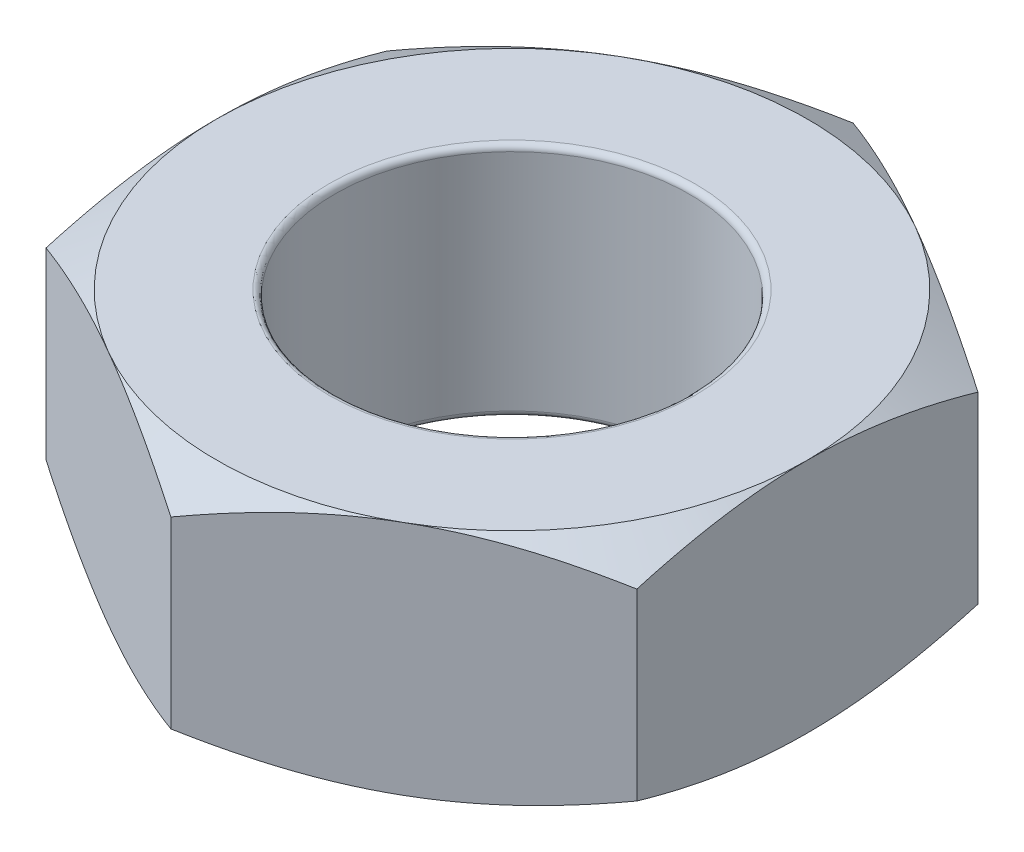
ISO-10303-21;
HEADER;
FILE_DESCRIPTION(('STEP AP214'),'2;1');
FILE_NAME('part.step','',(''),(''),'','','');
FILE_SCHEMA(('AUTOMOTIVE_DESIGN { 1 0 10303 214 1 1 1 1 }'));
ENDSEC;
DATA;
#1=APPLICATION_CONTEXT('core data for automotive mechanical design processes');
#2=APPLICATION_PROTOCOL_DEFINITION('international standard','automotive_design',2000,#1);
#3=PRODUCT_CONTEXT('',#1,'mechanical');
#4=PRODUCT('Part','Part','',(#3));
#5=PRODUCT_RELATED_PRODUCT_CATEGORY('part','',(#4));
#6=PRODUCT_DEFINITION_FORMATION('','',#4);
#7=PRODUCT_DEFINITION_CONTEXT('part definition',#1,'design');
#8=PRODUCT_DEFINITION('design','',#6,#7);
#9=PRODUCT_DEFINITION_SHAPE('','',#8);
#10=(LENGTH_UNIT() NAMED_UNIT(*) SI_UNIT(.MILLI.,.METRE.));
#11=(NAMED_UNIT(*) PLANE_ANGLE_UNIT() SI_UNIT($,.RADIAN.));
#12=(NAMED_UNIT(*) SI_UNIT($,.STERADIAN.) SOLID_ANGLE_UNIT());
#13=UNCERTAINTY_MEASURE_WITH_UNIT(LENGTH_MEASURE(1.E-05),#10,'distance_accuracy_value','');
#14=(GEOMETRIC_REPRESENTATION_CONTEXT(3) GLOBAL_UNCERTAINTY_ASSIGNED_CONTEXT((#13)) GLOBAL_UNIT_ASSIGNED_CONTEXT((#10,
#11,#12)) REPRESENTATION_CONTEXT('',''));
#15=CARTESIAN_POINT('',(0.,0.,0.));
#16=DIRECTION('',(0.,0.,1.));
#17=DIRECTION('',(1.,0.,0.));
#18=AXIS2_PLACEMENT_3D('',#15,#16,#17);
#19=CARTESIAN_POINT('',(0.,2.,2.88675134594813));
#20=DIRECTION('',(-0.5,0.,-0.866025403784439));
#21=DIRECTION('',(-0.866025403784439,0.,0.5));
#22=AXIS2_PLACEMENT_3D('',#19,#20,#21);
#23=PLANE('',#22);
#24=CARTESIAN_POINT('',(2.5002,0.223357664359108,1.44326020292023));
#25=CARTESIAN_POINT('',(2.39033676526513,0.186721620107626,1.50668977106845));
#26=CARTESIAN_POINT('',(2.27952520010347,0.153402218965056,1.57066685804385));
#27=CARTESIAN_POINT('',(2.05598316653395,0.0952422855578578,1.69972891130041));
#28=CARTESIAN_POINT('',(1.94324872547161,0.0704223291477384,1.7648161711947));
#29=CARTESIAN_POINT('',(1.71917700612473,0.0317856514410522,1.8941840386774));
#30=CARTESIAN_POINT('',(1.60787420823262,0.0177117961856392,1.95844473900197));
#31=CARTESIAN_POINT('',(1.38474477253167,0.00090915235275052,2.08726857876805));
#32=CARTESIAN_POINT('',(1.27291894598577,-0.00183354879637316,2.15183124982667));
#33=CARTESIAN_POINT('',(1.06395802444848,0.00386576000805371,2.27247489412634));
#34=CARTESIAN_POINT('',(0.966791682442268,0.0109083943818619,2.32857390783979));
#35=CARTESIAN_POINT('',(0.773092050288997,0.0332314191249426,2.44040644260542));
#36=CARTESIAN_POINT('',(0.676559430340267,0.0485194384402671,2.4961395767184));
#37=CARTESIAN_POINT('',(0.482460278259523,0.0867390938444202,2.60820277442169));
#38=CARTESIAN_POINT('',(0.384918318217858,0.109832776125517,2.66451865130903));
#39=CARTESIAN_POINT('',(0.191289391923914,0.162246656577913,2.77631036402774));
#40=CARTESIAN_POINT('',(0.0951999441138228,0.191554535624548,2.83178763258718));
#41=CARTESIAN_POINT('',(-0.00020000000000132,0.223357664359108,2.88686681600197));
#42=B_SPLINE_CURVE_WITH_KNOTS('',3,(#24,#25,#26,#27,#28,#29,#30,#31,#32,#33,#34,#35,#36,#37,#38,
#39,#40,#41),.UNSPECIFIED.,.F.,.F.,(4,2,2,2,2,2,2,2,4),(0.,0.396285827362227,0.793524330152051,
1.18093086852114,1.56786160134475,1.90479741793733,2.24204551660463,2.58677531536756,
2.93082800105256),.UNSPECIFIED.);
#43=CARTESIAN_POINT('',(2.5,0.223290993692602,1.44337567297407));
#44=VERTEX_POINT('',#43);
#45=CARTESIAN_POINT('',(1.25,0.,2.1650635094611));
#46=VERTEX_POINT('',#45);
#47=EDGE_CURVE('E128',#44,#46,#42,.T.);
#48=ORIENTED_EDGE('',*,*,#47,.F.);
#49=DIRECTION('',(0.,-1.,0.));
#50=VECTOR('',#49,1.);
#51=CARTESIAN_POINT('',(2.5,2.,1.44337567297407));
#52=LINE('',#51,#50);
#53=CARTESIAN_POINT('',(2.5,1.7767090063074,1.44337567297407));
#54=VERTEX_POINT('',#53);
#55=EDGE_CURVE('E234',#54,#44,#52,.T.);
#56=ORIENTED_EDGE('',*,*,#55,.F.);
#57=CARTESIAN_POINT('',(-0.000200000000001105,1.77664233564089,2.88686681600197));
#58=CARTESIAN_POINT('',(0.10966323473487,1.81327837989237,2.82343724785375));
#59=CARTESIAN_POINT('',(0.220474799896525,1.84659778103494,2.75946016087834));
#60=CARTESIAN_POINT('',(0.444016833466049,1.90475771444214,2.63039810762178));
#61=CARTESIAN_POINT('',(0.556751274528387,1.92957767085226,2.5653108477275));
#62=CARTESIAN_POINT('',(0.780822993875268,1.96821434855895,2.43594298024479));
#63=CARTESIAN_POINT('',(0.892125791767376,1.98228820381436,2.37168227992023));
#64=CARTESIAN_POINT('',(1.11525522746833,1.99909084764725,2.24285844015415));
#65=CARTESIAN_POINT('',(1.22708105401423,2.00183354879637,2.17829576909553));
#66=CARTESIAN_POINT('',(1.43604197555152,1.99613423999195,2.05765212479586));
#67=CARTESIAN_POINT('',(1.53320831755773,1.98909160561814,2.0015531110824));
#68=CARTESIAN_POINT('',(1.726907949711,1.96676858087506,1.88972057631678));
#69=CARTESIAN_POINT('',(1.82344056965973,1.95148056155973,1.8339874422038));
#70=CARTESIAN_POINT('',(2.01753972174048,1.91326090615558,1.7219242445005));
#71=CARTESIAN_POINT('',(2.11508168178214,1.89016722387448,1.66560836761317));
#72=CARTESIAN_POINT('',(2.30871060807609,1.83775334342209,1.55381665489446));
#73=CARTESIAN_POINT('',(2.40480005588618,1.80844546437545,1.49833938633502));
#74=CARTESIAN_POINT('',(2.5002,1.77664233564089,1.44326020292023));
#75=B_SPLINE_CURVE_WITH_KNOTS('',3,(#57,#58,#59,#60,#61,#62,#63,#64,#65,#66,#67,#68,#69,#70,#71,
#72,#73,#74),.UNSPECIFIED.,.F.,.F.,(4,2,2,2,2,2,2,2,4),(0.,0.396285827362227,0.793524330152051,
1.18093086852114,1.56786160134475,1.90479741793733,2.24204551660463,2.58677531536756,
2.93082800105256),.UNSPECIFIED.);
#76=CARTESIAN_POINT('',(1.25,2.,2.1650635094611));
#77=VERTEX_POINT('',#76);
#78=EDGE_CURVE('E375',#77,#54,#75,.T.);
#79=ORIENTED_EDGE('',*,*,#78,.F.);
#80=CARTESIAN_POINT('',(0.,1.7767090063074,2.88675134594813));
#81=VERTEX_POINT('',#80);
#82=EDGE_CURVE('E364',#81,#77,#75,.T.);
#83=ORIENTED_EDGE('',*,*,#82,.F.);
#84=DIRECTION('',(0.,-1.,0.));
#85=VECTOR('',#84,1.);
#86=CARTESIAN_POINT('',(0.,2.,2.88675134594813));
#87=LINE('',#86,#85);
#88=CARTESIAN_POINT('',(0.,0.223290993692601,2.88675134594813));
#89=VERTEX_POINT('',#88);
#90=EDGE_CURVE('E163',#81,#89,#87,.T.);
#91=ORIENTED_EDGE('',*,*,#90,.T.);
#92=EDGE_CURVE('E141',#46,#89,#42,.T.);
#93=ORIENTED_EDGE('',*,*,#92,.F.);
#94=EDGE_LOOP('',(#48,#56,#79,#83,#91,#93));
#95=FACE_BOUND('',#94,.T.);
#96=ADVANCED_FACE('F39',(#95),#23,.F.);
#97=CARTESIAN_POINT('',(2.5,2.,1.44337567297407));
#98=DIRECTION('',(-1.,0.,0.));
#99=DIRECTION('',(0.,0.,1.));
#100=AXIS2_PLACEMENT_3D('',#97,#98,#99);
#101=PLANE('',#100);
#102=CARTESIAN_POINT('',(2.5,1.75051746805577,-4.93486171933444));
#103=CARTESIAN_POINT('',(2.5,1.69133726261722,-4.8199403481942));
#104=CARTESIAN_POINT('',(2.5,1.63247825676005,-4.70485212642124));
#105=CARTESIAN_POINT('',(2.5,1.51556406119456,-4.47426567976795));
#106=CARTESIAN_POINT('',(2.5,1.45750888635444,-4.3587674473533));
#107=CARTESIAN_POINT('',(2.5,1.34227244134488,-4.12710089531367));
#108=CARTESIAN_POINT('',(2.5,1.28509274407798,-4.01093179192169));
#109=CARTESIAN_POINT('',(2.5,1.17192590701674,-3.77801122649482));
#110=CARTESIAN_POINT('',(2.5,1.11593878415348,-3.66125975622101));
#111=CARTESIAN_POINT('',(2.5,1.00253157682963,-3.42088300849687));
#112=CARTESIAN_POINT('',(2.5,0.94519156160896,-3.2972198482005));
#113=CARTESIAN_POINT('',(2.5,0.832598686179216,-3.04894788037271));
#114=CARTESIAN_POINT('',(2.5,0.777345769924557,-2.92433909834247));
#115=CARTESIAN_POINT('',(2.5,0.669564709168184,-2.67404231382757));
#116=CARTESIAN_POINT('',(2.5,0.617034744165751,-2.54835509963059));
#117=CARTESIAN_POINT('',(2.5,0.515470603951829,-2.29553518807958));
#118=CARTESIAN_POINT('',(2.5,0.466437240853759,-2.16840216282304));
#119=CARTESIAN_POINT('',(2.5,0.36551904558916,-1.89196933857389));
#120=CARTESIAN_POINT('',(2.5,0.314430928565565,-1.74237414052598));
#121=CARTESIAN_POINT('',(2.5,0.220856049236355,-1.4405551511059));
#122=CARTESIAN_POINT('',(2.5,0.178364945289853,-1.28833272889575));
#123=CARTESIAN_POINT('',(2.5,0.105752289587979,-0.983942199808397));
#124=CARTESIAN_POINT('',(2.5,0.0754089672818119,-0.831829132495783));
#125=CARTESIAN_POINT('',(2.5,0.0406516796303221,-0.602071425625843));
#126=CARTESIAN_POINT('',(2.5,0.0308592992319914,-0.525228449493817));
#127=CARTESIAN_POINT('',(2.5,0.0151636656794685,-0.371150643177173));
#128=CARTESIAN_POINT('',(2.5,0.00925981943211526,-0.293915874561849));
#129=CARTESIAN_POINT('',(2.5,0.00149945618362714,-0.13817730801555));
#130=CARTESIAN_POINT('',(2.5,-0.00030032968007229,-0.059670655857733));
#131=CARTESIAN_POINT('',(2.5,0.000382182470509023,0.0973237037747563));
#132=CARTESIAN_POINT('',(2.5,0.00286448024898988,0.175811411250471));
#133=CARTESIAN_POINT('',(2.5,0.0120180751018745,0.33255646239666));
#134=CARTESIAN_POINT('',(2.5,0.0186902391546223,0.410813755021101));
#135=CARTESIAN_POINT('',(2.5,0.0359818737124387,0.566895759516456));
#136=CARTESIAN_POINT('',(2.5,0.0466019878865537,0.644720398746936));
#137=CARTESIAN_POINT('',(2.5,0.0843776540425921,0.880425277323257));
#138=CARTESIAN_POINT('',(2.5,0.117244290445989,1.0374021276822));
#139=CARTESIAN_POINT('',(2.5,0.194551132550417,1.34841101742391));
#140=CARTESIAN_POINT('',(2.5,0.238994974726619,1.50244211517955));
#141=CARTESIAN_POINT('',(2.5,0.334467726657707,1.80198948227857));
#142=CARTESIAN_POINT('',(2.5,0.385183371784436,1.94760725909514));
#143=CARTESIAN_POINT('',(2.5,0.492317846941425,2.23674360042291));
#144=CARTESIAN_POINT('',(2.5,0.548738075330581,2.38026164031034));
#145=CARTESIAN_POINT('',(2.5,0.665809108984891,2.66572180096044));
#146=CARTESIAN_POINT('',(2.5,0.726464237701915,2.80766213451906));
#147=CARTESIAN_POINT('',(2.5,0.850881769521233,3.0901760741915));
#148=CARTESIAN_POINT('',(2.5,0.914644342755144,3.23074960496675));
#149=CARTESIAN_POINT('',(2.5,1.04081855009125,3.50283338488747));
#150=CARTESIAN_POINT('',(2.5,1.10310046173394,3.63440403331771));
#151=CARTESIAN_POINT('',(2.5,1.2292955254876,3.89676431270018));
#152=CARTESIAN_POINT('',(2.5,1.29320873128699,4.02755391777179));
#153=CARTESIAN_POINT('',(2.5,1.42210820195559,4.28806433847913));
#154=CARTESIAN_POINT('',(2.5,1.48709022600769,4.41778725733018));
#155=CARTESIAN_POINT('',(2.5,1.61808743263323,4.67669676330922));
#156=CARTESIAN_POINT('',(2.5,1.68410252583257,4.8058833956229));
#157=CARTESIAN_POINT('',(2.5,1.75051746805577,4.93486171933444));
#158=B_SPLINE_CURVE_WITH_KNOTS('',3,(#102,#103,#104,#105,#106,#107,#108,#109,#110,#111,#112,
#113,#114,#115,#116,#117,#118,#119,#120,#121,#122,#123,#124,#125,#126,#127,#128,#129,#130,#131,
#132,#133,#134,#135,#136,#137,#138,#139,#140,#141,#142,#143,#144,#145,#146,#147,#148,#149,#150,
#151,#152,#153,#154,#155,#156,#157),.UNSPECIFIED.,.F.,.F.,(4,2,2,2,2,2,2,2,2,2,2,2,2,2,2,2,2,2,
2,2,2,2,2,2,2,2,2,4),(0.,0.387793831894925,0.775594827128253,1.16402581850153,1.5524623207934,
1.96137758264064,2.37028185592793,2.77890912291195,3.1876309897647,3.66167496284643,
4.13547893462243,4.60018855861607,4.83249783003166,5.06477166059454,5.30023727903514,
5.53570288450944,5.77121722921933,6.00676998875774,6.48725754661897,6.96789621109927,
7.43032586595214,7.89286915182352,8.35589175957823,8.81893974621792,9.25562834373433,
9.69233133192937,10.1275921173417,10.5628154528867),.UNSPECIFIED.);
#159=CARTESIAN_POINT('',(2.5,0.223290993692601,-1.44337567297406));
#160=VERTEX_POINT('',#159);
#161=CARTESIAN_POINT('',(2.5,0.,0.));
#162=VERTEX_POINT('',#161);
#163=EDGE_CURVE('E54',#160,#162,#158,.T.);
#164=ORIENTED_EDGE('',*,*,#163,.F.);
#165=DIRECTION('',(0.,-1.,0.));
#166=VECTOR('',#165,1.);
#167=CARTESIAN_POINT('',(2.5,2.,-1.44337567297406));
#168=LINE('',#167,#166);
#169=CARTESIAN_POINT('',(2.5,1.7767090063074,-1.44337567297406));
#170=VERTEX_POINT('',#169);
#171=EDGE_CURVE('E367',#170,#160,#168,.T.);
#172=ORIENTED_EDGE('',*,*,#171,.F.);
#173=CARTESIAN_POINT('',(2.5,0.249482531944227,4.93486171933444));
#174=CARTESIAN_POINT('',(2.5,0.30866273738278,4.8199403481942));
#175=CARTESIAN_POINT('',(2.5,0.367521743239949,4.70485212642124));
#176=CARTESIAN_POINT('',(2.5,0.48443593880544,4.47426567976795));
#177=CARTESIAN_POINT('',(2.5,0.542491113645563,4.3587674473533));
#178=CARTESIAN_POINT('',(2.5,0.657727558655122,4.12710089531368));
#179=CARTESIAN_POINT('',(2.5,0.714907255922022,4.0109317919217));
#180=CARTESIAN_POINT('',(2.5,0.828074092983263,3.77801122649482));
#181=CARTESIAN_POINT('',(2.5,0.884061215846521,3.66125975622102));
#182=CARTESIAN_POINT('',(2.5,0.997468423170368,3.42088300849687));
#183=CARTESIAN_POINT('',(2.5,1.05480843839104,3.2972198482005));
#184=CARTESIAN_POINT('',(2.5,1.16740131382078,3.04894788037271));
#185=CARTESIAN_POINT('',(2.5,1.22265423007544,2.92433909834247));
#186=CARTESIAN_POINT('',(2.5,1.33043529083182,2.67404231382757));
#187=CARTESIAN_POINT('',(2.5,1.38296525583425,2.54835509963059));
#188=CARTESIAN_POINT('',(2.5,1.48452939604817,2.29553518807958));
#189=CARTESIAN_POINT('',(2.5,1.53356275914624,2.16840216282304));
#190=CARTESIAN_POINT('',(2.5,1.63448095441084,1.89196933857389));
#191=CARTESIAN_POINT('',(2.5,1.68556907143443,1.74237414052598));
#192=CARTESIAN_POINT('',(2.5,1.77914395076365,1.4405551511059));
#193=CARTESIAN_POINT('',(2.5,1.82163505471015,1.28833272889575));
#194=CARTESIAN_POINT('',(2.5,1.89424771041202,0.983942199808396));
#195=CARTESIAN_POINT('',(2.5,1.92459103271819,0.831829132495783));
#196=CARTESIAN_POINT('',(2.5,1.95934832036968,0.602071425625843));
#197=CARTESIAN_POINT('',(2.5,1.96914070076801,0.525228449493817));
#198=CARTESIAN_POINT('',(2.5,1.98483633432053,0.371150643177173));
#199=CARTESIAN_POINT('',(2.5,1.99074018056788,0.293915874561849));
#200=CARTESIAN_POINT('',(2.5,1.99850054381637,0.13817730801555));
#201=CARTESIAN_POINT('',(2.5,2.00030032968007,0.0596706558577327));
#202=CARTESIAN_POINT('',(2.5,1.99961781752949,-0.0973237037747565));
#203=CARTESIAN_POINT('',(2.5,1.99713551975101,-0.175811411250471));
#204=CARTESIAN_POINT('',(2.5,1.98798192489813,-0.33255646239666));
#205=CARTESIAN_POINT('',(2.5,1.98130976084538,-0.410813755021101));
#206=CARTESIAN_POINT('',(2.5,1.96401812628756,-0.566895759516456));
#207=CARTESIAN_POINT('',(2.5,1.95339801211345,-0.644720398746936));
#208=CARTESIAN_POINT('',(2.5,1.91562234595741,-0.880425277323257));
#209=CARTESIAN_POINT('',(2.5,1.88275570955401,-1.0374021276822));
#210=CARTESIAN_POINT('',(2.5,1.80544886744958,-1.34841101742391));
#211=CARTESIAN_POINT('',(2.5,1.76100502527338,-1.50244211517955));
#212=CARTESIAN_POINT('',(2.5,1.66553227334229,-1.80198948227857));
#213=CARTESIAN_POINT('',(2.5,1.61481662821556,-1.94760725909514));
#214=CARTESIAN_POINT('',(2.5,1.50768215305858,-2.23674360042291));
#215=CARTESIAN_POINT('',(2.5,1.45126192466942,-2.38026164031034));
#216=CARTESIAN_POINT('',(2.5,1.33419089101511,-2.66572180096044));
#217=CARTESIAN_POINT('',(2.5,1.27353576229809,-2.80766213451906));
#218=CARTESIAN_POINT('',(2.5,1.14911823047877,-3.0901760741915));
#219=CARTESIAN_POINT('',(2.5,1.08535565724486,-3.23074960496675));
#220=CARTESIAN_POINT('',(2.5,0.959181449908747,-3.50283338488747));
#221=CARTESIAN_POINT('',(2.5,0.896899538266062,-3.63440403331771));
#222=CARTESIAN_POINT('',(2.5,0.770704474512403,-3.89676431270018));
#223=CARTESIAN_POINT('',(2.5,0.706791268713009,-4.02755391777179));
#224=CARTESIAN_POINT('',(2.5,0.577891798044409,-4.28806433847913));
#225=CARTESIAN_POINT('',(2.5,0.512909773992308,-4.41778725733018));
#226=CARTESIAN_POINT('',(2.5,0.381912567366775,-4.67669676330922));
#227=CARTESIAN_POINT('',(2.5,0.315897474167427,-4.8058833956229));
#228=CARTESIAN_POINT('',(2.5,0.249482531944227,-4.93486171933444));
#229=B_SPLINE_CURVE_WITH_KNOTS('',3,(#173,#174,#175,#176,#177,#178,#179,#180,#181,#182,#183,
#184,#185,#186,#187,#188,#189,#190,#191,#192,#193,#194,#195,#196,#197,#198,#199,#200,#201,#202,
#203,#204,#205,#206,#207,#208,#209,#210,#211,#212,#213,#214,#215,#216,#217,#218,#219,#220,#221,
#222,#223,#224,#225,#226,#227,#228),.UNSPECIFIED.,.F.,.F.,(4,2,2,2,2,2,2,2,2,2,2,2,2,2,2,2,2,2,
2,2,2,2,2,2,2,2,2,4),(0.,0.387793831894924,0.775594827128252,1.16402581850153,1.5524623207934,
1.96137758264064,2.37028185592793,2.77890912291195,3.1876309897647,3.66167496284643,
4.13547893462244,4.60018855861608,4.83249783003166,5.06477166059454,5.30023727903514,
5.53570288450945,5.77121722921934,6.00676998875775,6.48725754661897,6.96789621109928,
7.43032586595214,7.89286915182353,8.35589175957824,8.81893974621792,9.25562834373433,
9.69233133192937,10.1275921173417,10.5628154528867),.UNSPECIFIED.);
#230=CARTESIAN_POINT('',(2.5,2.,0.));
#231=VERTEX_POINT('',#230);
#232=EDGE_CURVE('E274',#231,#170,#229,.T.);
#233=ORIENTED_EDGE('',*,*,#232,.F.);
#234=EDGE_CURVE('E374',#54,#231,#229,.T.);
#235=ORIENTED_EDGE('',*,*,#234,.F.);
#236=ORIENTED_EDGE('',*,*,#55,.T.);
#237=EDGE_CURVE('E135',#162,#44,#158,.T.);
#238=ORIENTED_EDGE('',*,*,#237,.F.);
#239=EDGE_LOOP('',(#164,#172,#233,#235,#236,#238));
#240=FACE_BOUND('',#239,.T.);
#241=ADVANCED_FACE('F259',(#240),#101,.F.);
#242=CARTESIAN_POINT('',(2.5,2.,-1.44337567297406));
#243=DIRECTION('',(-0.5,0.,0.866025403784438));
#244=DIRECTION('',(0.866025403784439,0.,0.5));
#245=AXIS2_PLACEMENT_3D('',#242,#243,#244);
#246=PLANE('',#245);
#247=CARTESIAN_POINT('',(-0.0002,0.223357664359109,-2.88686681600197));
#248=CARTESIAN_POINT('',(0.109663234734871,0.186721620107626,-2.82343724785375));
#249=CARTESIAN_POINT('',(0.220474799896526,0.153402218965057,-2.75946016087834));
#250=CARTESIAN_POINT('',(0.444016833466049,0.0952422855578582,-2.63039810762178));
#251=CARTESIAN_POINT('',(0.556751274528388,0.0704223291477387,-2.5653108477275));
#252=CARTESIAN_POINT('',(0.780822993875268,0.0317856514410524,-2.43594298024479));
#253=CARTESIAN_POINT('',(0.892125791767377,0.0177117961856394,-2.37168227992023));
#254=CARTESIAN_POINT('',(1.11525522746833,0.000909152352750615,-2.24285844015415));
#255=CARTESIAN_POINT('',(1.22708105401423,-0.00183354879637305,-2.17829576909553));
#256=CARTESIAN_POINT('',(1.43604197555152,0.00386576000805372,-2.05765212479586));
#257=CARTESIAN_POINT('',(1.53320831755773,0.0109083943818618,-2.0015531110824));
#258=CARTESIAN_POINT('',(1.726907949711,0.0332314191249426,-1.88972057631678));
#259=CARTESIAN_POINT('',(1.82344056965973,0.0485194384402672,-1.8339874422038));
#260=CARTESIAN_POINT('',(2.01753972174048,0.0867390938444203,-1.7219242445005));
#261=CARTESIAN_POINT('',(2.11508168178214,0.109832776125517,-1.66560836761316));
#262=CARTESIAN_POINT('',(2.30871060807609,0.162246656577913,-1.55381665489446));
#263=CARTESIAN_POINT('',(2.40480005588618,0.191554535624548,-1.49833938633502));
#264=CARTESIAN_POINT('',(2.5002,0.223357664359108,-1.44326020292023));
#265=B_SPLINE_CURVE_WITH_KNOTS('',3,(#247,#248,#249,#250,#251,#252,#253,#254,#255,#256,#257,
#258,#259,#260,#261,#262,#263,#264),.UNSPECIFIED.,.F.,.F.,(4,2,2,2,2,2,2,2,4),(0.,
0.396285827362227,0.793524330152051,1.18093086852114,1.56786160134475,1.90479741793733,
2.24204551660463,2.58677531536756,2.93082800105256),.UNSPECIFIED.);
#266=CARTESIAN_POINT('',(0.,0.223290993692602,-2.88675134594813));
#267=VERTEX_POINT('',#266);
#268=CARTESIAN_POINT('',(1.25,0.,-2.1650635094611));
#269=VERTEX_POINT('',#268);
#270=EDGE_CURVE('E62',#267,#269,#265,.T.);
#271=ORIENTED_EDGE('',*,*,#270,.F.);
#272=DIRECTION('',(0.,-1.,0.));
#273=VECTOR('',#272,1.);
#274=CARTESIAN_POINT('',(0.,2.,-2.88675134594813));
#275=LINE('',#274,#273);
#276=CARTESIAN_POINT('',(0.,1.7767090063074,-2.88675134594813));
#277=VERTEX_POINT('',#276);
#278=EDGE_CURVE('E362',#277,#267,#275,.T.);
#279=ORIENTED_EDGE('',*,*,#278,.F.);
#280=CARTESIAN_POINT('',(2.5002,1.77664233564089,-1.44326020292023));
#281=CARTESIAN_POINT('',(2.39033676526513,1.81327837989237,-1.50668977106845));
#282=CARTESIAN_POINT('',(2.27952520010347,1.84659778103494,-1.57066685804385));
#283=CARTESIAN_POINT('',(2.05598316653395,1.90475771444214,-1.69972891130041));
#284=CARTESIAN_POINT('',(1.94324872547161,1.92957767085226,-1.7648161711947));
#285=CARTESIAN_POINT('',(1.71917700612473,1.96821434855895,-1.8941840386774));
#286=CARTESIAN_POINT('',(1.60787420823262,1.98228820381436,-1.95844473900197));
#287=CARTESIAN_POINT('',(1.38474477253167,1.99909084764725,-2.08726857876804));
#288=CARTESIAN_POINT('',(1.27291894598577,2.00183354879637,-2.15183124982667));
#289=CARTESIAN_POINT('',(1.06395802444848,1.99613423999195,-2.27247489412634));
#290=CARTESIAN_POINT('',(0.966791682442269,1.98909160561814,-2.32857390783979));
#291=CARTESIAN_POINT('',(0.773092050288998,1.96676858087506,-2.44040644260542));
#292=CARTESIAN_POINT('',(0.676559430340268,1.95148056155973,-2.4961395767184));
#293=CARTESIAN_POINT('',(0.482460278259524,1.91326090615558,-2.60820277442169));
#294=CARTESIAN_POINT('',(0.38491831821786,1.89016722387448,-2.66451865130903));
#295=CARTESIAN_POINT('',(0.191289391923915,1.83775334342209,-2.77631036402774));
#296=CARTESIAN_POINT('',(0.0951999441138242,1.80844546437545,-2.83178763258718));
#297=CARTESIAN_POINT('',(-0.000199999999999505,1.77664233564089,-2.88686681600197));
#298=B_SPLINE_CURVE_WITH_KNOTS('',3,(#280,#281,#282,#283,#284,#285,#286,#287,#288,#289,#290,
#291,#292,#293,#294,#295,#296,#297),.UNSPECIFIED.,.F.,.F.,(4,2,2,2,2,2,2,2,4),(0.,
0.396285827362227,0.793524330152051,1.18093086852114,1.56786160134475,1.90479741793733,
2.24204551660463,2.58677531536756,2.93082800105256),.UNSPECIFIED.);
#299=CARTESIAN_POINT('',(1.25,2.,-2.1650635094611));
#300=VERTEX_POINT('',#299);
#301=EDGE_CURVE('E323',#300,#277,#298,.T.);
#302=ORIENTED_EDGE('',*,*,#301,.F.);
#303=EDGE_CURVE('E381',#170,#300,#298,.T.);
#304=ORIENTED_EDGE('',*,*,#303,.F.);
#305=ORIENTED_EDGE('',*,*,#171,.T.);
#306=EDGE_CURVE('E201',#269,#160,#265,.T.);
#307=ORIENTED_EDGE('',*,*,#306,.F.);
#308=EDGE_LOOP('',(#271,#279,#302,#304,#305,#307));
#309=FACE_BOUND('',#308,.T.);
#310=ADVANCED_FACE('F263',(#309),#246,.F.);
#311=CARTESIAN_POINT('',(0.,2.,-2.88675134594813));
#312=DIRECTION('',(0.5,0.,0.866025403784439));
#313=DIRECTION('',(0.866025403784439,0.,-0.5));
#314=AXIS2_PLACEMENT_3D('',#311,#312,#313);
#315=PLANE('',#314);
#316=CARTESIAN_POINT('',(-2.5002,0.223357664359109,-1.44326020292023));
#317=CARTESIAN_POINT('',(-2.39033676526513,0.186721620107626,-1.50668977106845));
#318=CARTESIAN_POINT('',(-2.27952520010348,0.153402218965057,-1.57066685804385));
#319=CARTESIAN_POINT('',(-2.05598316653395,0.0952422855578584,-1.69972891130041));
#320=CARTESIAN_POINT('',(-1.94324872547161,0.0704223291477389,-1.7648161711947));
#321=CARTESIAN_POINT('',(-1.71917700612473,0.0317856514410528,-1.8941840386774));
#322=CARTESIAN_POINT('',(-1.60787420823262,0.0177117961856398,-1.95844473900197));
#323=CARTESIAN_POINT('',(-1.38474477253167,0.000909152352751027,-2.08726857876805));
#324=CARTESIAN_POINT('',(-1.27291894598577,-0.00183354879637277,-2.15183124982667));
#325=CARTESIAN_POINT('',(-1.06395802444848,0.00386576000805407,-2.27247489412634));
#326=CARTESIAN_POINT('',(-0.96679168244227,0.0109083943818623,-2.32857390783979));
#327=CARTESIAN_POINT('',(-0.773092050288998,0.0332314191249431,-2.44040644260542));
#328=CARTESIAN_POINT('',(-0.676559430340268,0.0485194384402677,-2.4961395767184));
#329=CARTESIAN_POINT('',(-0.482460278259524,0.0867390938444207,-2.60820277442169));
#330=CARTESIAN_POINT('',(-0.38491831821786,0.109832776125517,-2.66451865130903));
#331=CARTESIAN_POINT('',(-0.191289391923915,0.162246656577913,-2.77631036402774));
#332=CARTESIAN_POINT('',(-0.0951999441138237,0.191554535624549,-2.83178763258718));
#333=CARTESIAN_POINT('',(0.000200000000000389,0.223357664359109,-2.88686681600197));
#334=B_SPLINE_CURVE_WITH_KNOTS('',3,(#316,#317,#318,#319,#320,#321,#322,#323,#324,#325,#326,
#327,#328,#329,#330,#331,#332,#333),.UNSPECIFIED.,.F.,.F.,(4,2,2,2,2,2,2,2,4),(0.,
0.396285827362227,0.793524330152051,1.18093086852114,1.56786160134475,1.90479741793733,
2.24204551660463,2.58677531536756,2.93082800105257),.UNSPECIFIED.);
#335=CARTESIAN_POINT('',(-2.5,0.223290993692596,-1.44337567297408));
#336=VERTEX_POINT('',#335);
#337=CARTESIAN_POINT('',(-1.25,0.,-2.1650635094611));
#338=VERTEX_POINT('',#337);
#339=EDGE_CURVE('E179',#336,#338,#334,.T.);
#340=ORIENTED_EDGE('',*,*,#339,.F.);
#341=DIRECTION('',(0.,-1.,0.));
#342=VECTOR('',#341,1.);
#343=CARTESIAN_POINT('',(-2.5,2.,-1.44337567297407));
#344=LINE('',#343,#342);
#345=CARTESIAN_POINT('',(-2.5,1.7767090063074,-1.44337567297407));
#346=VERTEX_POINT('',#345);
#347=EDGE_CURVE('E330',#346,#336,#344,.T.);
#348=ORIENTED_EDGE('',*,*,#347,.F.);
#349=CARTESIAN_POINT('',(0.000200000000000046,1.77664233564089,-2.88686681600197));
#350=CARTESIAN_POINT('',(-0.109663234734871,1.81327837989237,-2.82343724785375));
#351=CARTESIAN_POINT('',(-0.220474799896526,1.84659778103494,-2.75946016087834));
#352=CARTESIAN_POINT('',(-0.44401683346605,1.90475771444214,-2.63039810762178));
#353=CARTESIAN_POINT('',(-0.556751274528388,1.92957767085226,-2.5653108477275));
#354=CARTESIAN_POINT('',(-0.780822993875269,1.96821434855895,-2.43594298024479));
#355=CARTESIAN_POINT('',(-0.892125791767377,1.98228820381436,-2.37168227992023));
#356=CARTESIAN_POINT('',(-1.11525522746833,1.99909084764725,-2.24285844015415));
#357=CARTESIAN_POINT('',(-1.22708105401423,2.00183354879637,-2.17829576909553));
#358=CARTESIAN_POINT('',(-1.43604197555152,1.99613423999195,-2.05765212479586));
#359=CARTESIAN_POINT('',(-1.53320831755773,1.98909160561814,-2.0015531110824));
#360=CARTESIAN_POINT('',(-1.726907949711,1.96676858087506,-1.88972057631678));
#361=CARTESIAN_POINT('',(-1.82344056965973,1.95148056155973,-1.8339874422038));
#362=CARTESIAN_POINT('',(-2.01753972174048,1.91326090615558,-1.7219242445005));
#363=CARTESIAN_POINT('',(-2.11508168178214,1.89016722387448,-1.66560836761316));
#364=CARTESIAN_POINT('',(-2.30871060807609,1.83775334342209,-1.55381665489446));
#365=CARTESIAN_POINT('',(-2.40480005588618,1.80844546437545,-1.49833938633502));
#366=CARTESIAN_POINT('',(-2.5002,1.77664233564089,-1.44326020292023));
#367=B_SPLINE_CURVE_WITH_KNOTS('',3,(#349,#350,#351,#352,#353,#354,#355,#356,#357,#358,#359,
#360,#361,#362,#363,#364,#365,#366),.UNSPECIFIED.,.F.,.F.,(4,2,2,2,2,2,2,2,4),(0.,
0.396285827362227,0.793524330152051,1.18093086852114,1.56786160134475,1.90479741793733,
2.24204551660463,2.58677531536756,2.93082800105257),.UNSPECIFIED.);
#368=CARTESIAN_POINT('',(-1.25,2.,-2.1650635094611));
#369=VERTEX_POINT('',#368);
#370=EDGE_CURVE('E314',#369,#346,#367,.T.);
#371=ORIENTED_EDGE('',*,*,#370,.F.);
#372=EDGE_CURVE('E319',#277,#369,#367,.T.);
#373=ORIENTED_EDGE('',*,*,#372,.F.);
#374=ORIENTED_EDGE('',*,*,#278,.T.);
#375=EDGE_CURVE('E285',#338,#267,#334,.T.);
#376=ORIENTED_EDGE('',*,*,#375,.F.);
#377=EDGE_LOOP('',(#340,#348,#371,#373,#374,#376));
#378=FACE_BOUND('',#377,.T.);
#379=ADVANCED_FACE('F268',(#378),#315,.F.);
#380=CARTESIAN_POINT('',(-2.5,2.,-1.44337567297407));
#381=DIRECTION('',(1.,0.,0.));
#382=DIRECTION('',(0.,0.,-1.));
#383=AXIS2_PLACEMENT_3D('',#380,#381,#382);
#384=PLANE('',#383);
#385=CARTESIAN_POINT('',(-2.5,1.75051746805577,4.93486171933444));
#386=CARTESIAN_POINT('',(-2.5,1.69133726261722,4.8199403481942));
#387=CARTESIAN_POINT('',(-2.5,1.63247825676005,4.70485212642124));
#388=CARTESIAN_POINT('',(-2.5,1.51556406119456,4.47426567976795));
#389=CARTESIAN_POINT('',(-2.5,1.45750888635444,4.3587674473533));
#390=CARTESIAN_POINT('',(-2.5,1.34227244134488,4.12710089531367));
#391=CARTESIAN_POINT('',(-2.5,1.28509274407798,4.01093179192169));
#392=CARTESIAN_POINT('',(-2.5,1.17192590701674,3.77801122649482));
#393=CARTESIAN_POINT('',(-2.5,1.11593878415348,3.66125975622101));
#394=CARTESIAN_POINT('',(-2.5,1.00253157682963,3.42088300849687));
#395=CARTESIAN_POINT('',(-2.5,0.94519156160896,3.2972198482005));
#396=CARTESIAN_POINT('',(-2.5,0.832598686179216,3.04894788037271));
#397=CARTESIAN_POINT('',(-2.5,0.777345769924557,2.92433909834247));
#398=CARTESIAN_POINT('',(-2.5,0.669564709168184,2.67404231382757));
#399=CARTESIAN_POINT('',(-2.5,0.617034744165752,2.54835509963059));
#400=CARTESIAN_POINT('',(-2.5,0.515470603951829,2.29553518807957));
#401=CARTESIAN_POINT('',(-2.5,0.466437240853759,2.16840216282304));
#402=CARTESIAN_POINT('',(-2.5,0.36551904558916,1.89196933857388));
#403=CARTESIAN_POINT('',(-2.5,0.314430928565565,1.74237414052597));
#404=CARTESIAN_POINT('',(-2.5,0.220856049236355,1.4405551511059));
#405=CARTESIAN_POINT('',(-2.5,0.178364945289854,1.28833272889575));
#406=CARTESIAN_POINT('',(-2.5,0.10575228958798,0.983942199808395));
#407=CARTESIAN_POINT('',(-2.5,0.0754089672818119,0.831829132495781));
#408=CARTESIAN_POINT('',(-2.5,0.0406516796303225,0.602071425625841));
#409=CARTESIAN_POINT('',(-2.5,0.030859299231992,0.525228449493815));
#410=CARTESIAN_POINT('',(-2.5,0.0151636656794694,0.371150643177171));
#411=CARTESIAN_POINT('',(-2.5,0.00925981943211605,0.293915874561846));
#412=CARTESIAN_POINT('',(-2.5,0.00149945618362785,0.138177308015547));
#413=CARTESIAN_POINT('',(-2.5,-0.000300329680071608,0.05967065585773));
#414=CARTESIAN_POINT('',(-2.5,0.000382182470509842,-0.0973237037747595));
#415=CARTESIAN_POINT('',(-2.5,0.00286448024899085,-0.175811411250475));
#416=CARTESIAN_POINT('',(-2.5,0.0120180751018756,-0.332556462396663));
#417=CARTESIAN_POINT('',(-2.5,0.0186902391546232,-0.410813755021104));
#418=CARTESIAN_POINT('',(-2.5,0.0359818737124397,-0.566895759516459));
#419=CARTESIAN_POINT('',(-2.5,0.0466019878865549,-0.644720398746939));
#420=CARTESIAN_POINT('',(-2.5,0.0843776540425934,-0.88042527732326));
#421=CARTESIAN_POINT('',(-2.5,0.11724429044599,-1.0374021276822));
#422=CARTESIAN_POINT('',(-2.5,0.194551132550418,-1.34841101742391));
#423=CARTESIAN_POINT('',(-2.5,0.23899497472662,-1.50244211517955));
#424=CARTESIAN_POINT('',(-2.5,0.334467726657708,-1.80198948227857));
#425=CARTESIAN_POINT('',(-2.5,0.385183371784438,-1.94760725909515));
#426=CARTESIAN_POINT('',(-2.5,0.492317846941426,-2.23674360042291));
#427=CARTESIAN_POINT('',(-2.5,0.548738075330582,-2.38026164031034));
#428=CARTESIAN_POINT('',(-2.5,0.665809108984892,-2.66572180096044));
#429=CARTESIAN_POINT('',(-2.5,0.726464237701915,-2.80766213451906));
#430=CARTESIAN_POINT('',(-2.5,0.850881769521233,-3.0901760741915));
#431=CARTESIAN_POINT('',(-2.5,0.914644342755144,-3.23074960496675));
#432=CARTESIAN_POINT('',(-2.5,1.04081855009125,-3.50283338488746));
#433=CARTESIAN_POINT('',(-2.5,1.10310046173394,-3.63440403331771));
#434=CARTESIAN_POINT('',(-2.5,1.2292955254876,-3.89676431270018));
#435=CARTESIAN_POINT('',(-2.5,1.29320873128699,-4.02755391777178));
#436=CARTESIAN_POINT('',(-2.5,1.42210820195559,-4.28806433847912));
#437=CARTESIAN_POINT('',(-2.5,1.48709022600769,-4.41778725733018));
#438=CARTESIAN_POINT('',(-2.5,1.61808743263322,-4.67669676330922));
#439=CARTESIAN_POINT('',(-2.5,1.68410252583257,-4.8058833956229));
#440=CARTESIAN_POINT('',(-2.5,1.75051746805577,-4.93486171933444));
#441=B_SPLINE_CURVE_WITH_KNOTS('',3,(#385,#386,#387,#388,#389,#390,#391,#392,#393,#394,#395,
#396,#397,#398,#399,#400,#401,#402,#403,#404,#405,#406,#407,#408,#409,#410,#411,#412,#413,#414,
#415,#416,#417,#418,#419,#420,#421,#422,#423,#424,#425,#426,#427,#428,#429,#430,#431,#432,#433,
#434,#435,#436,#437,#438,#439,#440),.UNSPECIFIED.,.F.,.F.,(4,2,2,2,2,2,2,2,2,2,2,2,2,2,2,2,2,2,
2,2,2,2,2,2,2,2,2,4),(0.,0.387793831894925,0.775594827128252,1.16402581850153,1.5524623207934,
1.96137758264064,2.37028185592793,2.77890912291195,3.1876309897647,3.66167496284643,
4.13547893462243,4.60018855861608,4.83249783003166,5.06477166059454,5.30023727903514,
5.53570288450944,5.77121722921933,6.00676998875775,6.48725754661897,6.96789621109928,
7.43032586595214,7.89286915182353,8.35589175957823,8.81893974621792,9.25562834373433,
9.69233133192937,10.1275921173417,10.5628154528867),.UNSPECIFIED.);
#442=CARTESIAN_POINT('',(-2.5,0.223290993692602,1.44337567297406));
#443=VERTEX_POINT('',#442);
#444=CARTESIAN_POINT('',(-2.5,0.,0.));
#445=VERTEX_POINT('',#444);
#446=EDGE_CURVE('E164',#443,#445,#441,.T.);
#447=ORIENTED_EDGE('',*,*,#446,.F.);
#448=DIRECTION('',(0.,-1.,0.));
#449=VECTOR('',#448,1.);
#450=CARTESIAN_POINT('',(-2.5,2.,1.44337567297406));
#451=LINE('',#450,#449);
#452=CARTESIAN_POINT('',(-2.5,1.7767090063074,1.44337567297406));
#453=VERTEX_POINT('',#452);
#454=EDGE_CURVE('E356',#453,#443,#451,.T.);
#455=ORIENTED_EDGE('',*,*,#454,.F.);
#456=CARTESIAN_POINT('',(-2.5,0.249482531944228,-4.93486171933444));
#457=CARTESIAN_POINT('',(-2.5,0.308662737382781,-4.8199403481942));
#458=CARTESIAN_POINT('',(-2.5,0.36752174323995,-4.70485212642124));
#459=CARTESIAN_POINT('',(-2.5,0.48443593880544,-4.47426567976795));
#460=CARTESIAN_POINT('',(-2.5,0.542491113645563,-4.3587674473533));
#461=CARTESIAN_POINT('',(-2.5,0.657727558655123,-4.12710089531368));
#462=CARTESIAN_POINT('',(-2.5,0.714907255922022,-4.01093179192169));
#463=CARTESIAN_POINT('',(-2.5,0.828074092983264,-3.77801122649482));
#464=CARTESIAN_POINT('',(-2.5,0.884061215846521,-3.66125975622101));
#465=CARTESIAN_POINT('',(-2.5,0.997468423170368,-3.42088300849687));
#466=CARTESIAN_POINT('',(-2.5,1.05480843839104,-3.2972198482005));
#467=CARTESIAN_POINT('',(-2.5,1.16740131382078,-3.04894788037271));
#468=CARTESIAN_POINT('',(-2.5,1.22265423007544,-2.92433909834247));
#469=CARTESIAN_POINT('',(-2.5,1.33043529083182,-2.67404231382757));
#470=CARTESIAN_POINT('',(-2.5,1.38296525583425,-2.54835509963059));
#471=CARTESIAN_POINT('',(-2.5,1.48452939604817,-2.29553518807958));
#472=CARTESIAN_POINT('',(-2.5,1.53356275914624,-2.16840216282304));
#473=CARTESIAN_POINT('',(-2.5,1.63448095441084,-1.89196933857389));
#474=CARTESIAN_POINT('',(-2.5,1.68556907143443,-1.74237414052598));
#475=CARTESIAN_POINT('',(-2.5,1.77914395076364,-1.4405551511059));
#476=CARTESIAN_POINT('',(-2.5,1.82163505471015,-1.28833272889575));
#477=CARTESIAN_POINT('',(-2.5,1.89424771041202,-0.983942199808395));
#478=CARTESIAN_POINT('',(-2.5,1.92459103271819,-0.831829132495782));
#479=CARTESIAN_POINT('',(-2.5,1.95934832036968,-0.602071425625842));
#480=CARTESIAN_POINT('',(-2.5,1.96914070076801,-0.525228449493816));
#481=CARTESIAN_POINT('',(-2.5,1.98483633432053,-0.371150643177172));
#482=CARTESIAN_POINT('',(-2.5,1.99074018056788,-0.293915874561847));
#483=CARTESIAN_POINT('',(-2.5,1.99850054381637,-0.138177308015548));
#484=CARTESIAN_POINT('',(-2.5,2.00030032968007,-0.0596706558577308));
#485=CARTESIAN_POINT('',(-2.5,1.99961781752949,0.0973237037747587));
#486=CARTESIAN_POINT('',(-2.5,1.99713551975101,0.175811411250474));
#487=CARTESIAN_POINT('',(-2.5,1.98798192489812,0.332556462396662));
#488=CARTESIAN_POINT('',(-2.5,1.98130976084538,0.410813755021102));
#489=CARTESIAN_POINT('',(-2.5,1.96401812628756,0.566895759516458));
#490=CARTESIAN_POINT('',(-2.5,1.95339801211345,0.644720398746938));
#491=CARTESIAN_POINT('',(-2.5,1.91562234595741,0.880425277323259));
#492=CARTESIAN_POINT('',(-2.5,1.88275570955401,1.0374021276822));
#493=CARTESIAN_POINT('',(-2.5,1.80544886744958,1.34841101742391));
#494=CARTESIAN_POINT('',(-2.5,1.76100502527338,1.50244211517955));
#495=CARTESIAN_POINT('',(-2.5,1.66553227334229,1.80198948227857));
#496=CARTESIAN_POINT('',(-2.5,1.61481662821556,1.94760725909515));
#497=CARTESIAN_POINT('',(-2.5,1.50768215305857,2.23674360042291));
#498=CARTESIAN_POINT('',(-2.5,1.45126192466942,2.38026164031034));
#499=CARTESIAN_POINT('',(-2.5,1.33419089101511,2.66572180096044));
#500=CARTESIAN_POINT('',(-2.5,1.27353576229808,2.80766213451906));
#501=CARTESIAN_POINT('',(-2.5,1.14911823047877,3.0901760741915));
#502=CARTESIAN_POINT('',(-2.5,1.08535565724486,3.23074960496675));
#503=CARTESIAN_POINT('',(-2.5,0.959181449908748,3.50283338488746));
#504=CARTESIAN_POINT('',(-2.5,0.896899538266063,3.63440403331771));
#505=CARTESIAN_POINT('',(-2.5,0.770704474512404,3.89676431270017));
#506=CARTESIAN_POINT('',(-2.5,0.70679126871301,4.02755391777178));
#507=CARTESIAN_POINT('',(-2.5,0.57789179804441,4.28806433847912));
#508=CARTESIAN_POINT('',(-2.5,0.512909773992309,4.41778725733017));
#509=CARTESIAN_POINT('',(-2.5,0.381912567366777,4.67669676330922));
#510=CARTESIAN_POINT('',(-2.5,0.315897474167429,4.8058833956229));
#511=CARTESIAN_POINT('',(-2.5,0.249482531944229,4.93486171933444));
#512=B_SPLINE_CURVE_WITH_KNOTS('',3,(#456,#457,#458,#459,#460,#461,#462,#463,#464,#465,#466,
#467,#468,#469,#470,#471,#472,#473,#474,#475,#476,#477,#478,#479,#480,#481,#482,#483,#484,#485,
#486,#487,#488,#489,#490,#491,#492,#493,#494,#495,#496,#497,#498,#499,#500,#501,#502,#503,#504,
#505,#506,#507,#508,#509,#510,#511),.UNSPECIFIED.,.F.,.F.,(4,2,2,2,2,2,2,2,2,2,2,2,2,2,2,2,2,2,
2,2,2,2,2,2,2,2,2,4),(0.,0.387793831894924,0.775594827128251,1.16402581850153,1.5524623207934,
1.96137758264064,2.37028185592793,2.77890912291195,3.1876309897647,3.66167496284643,
4.13547893462243,4.60018855861608,4.83249783003166,5.06477166059454,5.30023727903514,
5.53570288450944,5.77121722921933,6.00676998875775,6.48725754661897,6.96789621109928,
7.43032586595214,7.89286915182353,8.35589175957823,8.81893974621792,9.25562834373433,
9.69233133192936,10.1275921173417,10.5628154528867),.UNSPECIFIED.);
#513=CARTESIAN_POINT('',(-2.5,2.,0.));
#514=VERTEX_POINT('',#513);
#515=EDGE_CURVE('E301',#514,#453,#512,.T.);
#516=ORIENTED_EDGE('',*,*,#515,.F.);
#517=EDGE_CURVE('E305',#346,#514,#512,.T.);
#518=ORIENTED_EDGE('',*,*,#517,.F.);
#519=ORIENTED_EDGE('',*,*,#347,.T.);
#520=EDGE_CURVE('E140',#445,#336,#441,.T.);
#521=ORIENTED_EDGE('',*,*,#520,.F.);
#522=EDGE_LOOP('',(#447,#455,#516,#518,#519,#521));
#523=FACE_BOUND('',#522,.T.);
#524=ADVANCED_FACE('F222',(#523),#384,.F.);
#525=CARTESIAN_POINT('',(-2.5,2.,1.44337567297406));
#526=DIRECTION('',(0.5,0.,-0.866025403784439));
#527=DIRECTION('',(-0.866025403784438,0.,-0.5));
#528=AXIS2_PLACEMENT_3D('',#525,#526,#527);
#529=PLANE('',#528);
#530=CARTESIAN_POINT('',(0.000199999999998963,0.223357664359108,2.88686681600197));
#531=CARTESIAN_POINT('',(-0.109663234734872,0.186721620107626,2.82343724785375));
#532=CARTESIAN_POINT('',(-0.220474799896526,0.153402218965056,2.75946016087834));
#533=CARTESIAN_POINT('',(-0.44401683346605,0.0952422855578578,2.63039810762178));
#534=CARTESIAN_POINT('',(-0.556751274528389,0.0704223291477385,2.5653108477275));
#535=CARTESIAN_POINT('',(-0.78082299387527,0.0317856514410523,2.43594298024479));
#536=CARTESIAN_POINT('',(-0.892125791767378,0.0177117961856391,2.37168227992023));
#537=CARTESIAN_POINT('',(-1.11525522746833,0.000909152352750381,2.24285844015415));
#538=CARTESIAN_POINT('',(-1.22708105401423,-0.00183354879637315,2.17829576909553));
#539=CARTESIAN_POINT('',(-1.43604197555152,0.00386576000805382,2.05765212479586));
#540=CARTESIAN_POINT('',(-1.53320831755773,0.010908394381862,2.0015531110824));
#541=CARTESIAN_POINT('',(-1.726907949711,0.0332314191249427,1.88972057631678));
#542=CARTESIAN_POINT('',(-1.82344056965973,0.0485194384402673,1.8339874422038));
#543=CARTESIAN_POINT('',(-2.01753972174048,0.0867390938444205,1.7219242445005));
#544=CARTESIAN_POINT('',(-2.11508168178214,0.109832776125517,1.66560836761316));
#545=CARTESIAN_POINT('',(-2.30871060807609,0.162246656577913,1.55381665489446));
#546=CARTESIAN_POINT('',(-2.40480005588618,0.191554535624549,1.49833938633502));
#547=CARTESIAN_POINT('',(-2.5002,0.223357664359108,1.44326020292023));
#548=B_SPLINE_CURVE_WITH_KNOTS('',3,(#530,#531,#532,#533,#534,#535,#536,#537,#538,#539,#540,
#541,#542,#543,#544,#545,#546,#547),.UNSPECIFIED.,.F.,.F.,(4,2,2,2,2,2,2,2,4),(0.,
0.396285827362226,0.793524330152051,1.18093086852114,1.56786160134475,1.90479741793733,
2.24204551660463,2.58677531536756,2.93082800105256),.UNSPECIFIED.);
#549=CARTESIAN_POINT('',(-1.25,0.,2.1650635094611));
#550=VERTEX_POINT('',#549);
#551=EDGE_CURVE('E148',#89,#550,#548,.T.);
#552=ORIENTED_EDGE('',*,*,#551,.F.);
#553=ORIENTED_EDGE('',*,*,#90,.F.);
#554=CARTESIAN_POINT('',(-2.5002,1.77664233564089,1.44326020292023));
#555=CARTESIAN_POINT('',(-2.39033676526513,1.81327837989237,1.50668977106845));
#556=CARTESIAN_POINT('',(-2.27952520010348,1.84659778103494,1.57066685804385));
#557=CARTESIAN_POINT('',(-2.05598316653395,1.90475771444214,1.69972891130041));
#558=CARTESIAN_POINT('',(-1.94324872547161,1.92957767085226,1.7648161711947));
#559=CARTESIAN_POINT('',(-1.71917700612473,1.96821434855895,1.8941840386774));
#560=CARTESIAN_POINT('',(-1.60787420823262,1.98228820381436,1.95844473900197));
#561=CARTESIAN_POINT('',(-1.38474477253167,1.99909084764725,2.08726857876804));
#562=CARTESIAN_POINT('',(-1.27291894598577,2.00183354879637,2.15183124982667));
#563=CARTESIAN_POINT('',(-1.06395802444848,1.99613423999195,2.27247489412634));
#564=CARTESIAN_POINT('',(-0.96679168244227,1.98909160561814,2.32857390783979));
#565=CARTESIAN_POINT('',(-0.773092050288999,1.96676858087506,2.44040644260542));
#566=CARTESIAN_POINT('',(-0.676559430340269,1.95148056155973,2.4961395767184));
#567=CARTESIAN_POINT('',(-0.482460278259525,1.91326090615558,2.60820277442169));
#568=CARTESIAN_POINT('',(-0.384918318217861,1.89016722387448,2.66451865130903));
#569=CARTESIAN_POINT('',(-0.191289391923916,1.83775334342209,2.77631036402774));
#570=CARTESIAN_POINT('',(-0.095199944113825,1.80844546437545,2.83178763258718));
#571=CARTESIAN_POINT('',(0.000199999999998994,1.77664233564089,2.88686681600197));
#572=B_SPLINE_CURVE_WITH_KNOTS('',3,(#554,#555,#556,#557,#558,#559,#560,#561,#562,#563,#564,
#565,#566,#567,#568,#569,#570,#571),.UNSPECIFIED.,.F.,.F.,(4,2,2,2,2,2,2,2,4),(0.,
0.396285827362227,0.793524330152051,1.18093086852114,1.56786160134475,1.90479741793733,
2.24204551660463,2.58677531536756,2.93082800105257),.UNSPECIFIED.);
#573=CARTESIAN_POINT('',(-1.25,2.,2.1650635094611));
#574=VERTEX_POINT('',#573);
#575=EDGE_CURVE('E228',#574,#81,#572,.T.);
#576=ORIENTED_EDGE('',*,*,#575,.F.);
#577=EDGE_CURVE('E153',#453,#574,#572,.T.);
#578=ORIENTED_EDGE('',*,*,#577,.F.);
#579=ORIENTED_EDGE('',*,*,#454,.T.);
#580=EDGE_CURVE('E210',#550,#443,#548,.T.);
#581=ORIENTED_EDGE('',*,*,#580,.F.);
#582=EDGE_LOOP('',(#552,#553,#576,#578,#579,#581));
#583=FACE_BOUND('',#582,.T.);
#584=ADVANCED_FACE('F218',(#583),#529,.F.);
#585=CARTESIAN_POINT('',(0.,0.,0.));
#586=DIRECTION('',(0.,1.,0.));
#587=DIRECTION('',(0.,0.,1.));
#588=AXIS2_PLACEMENT_3D('',#585,#586,#587);
#589=PLANE('',#588);
#590=CARTESIAN_POINT('',(0.,0.,0.));
#591=DIRECTION('',(0.,1.,0.));
#592=DIRECTION('',(0.,0.,1.));
#593=AXIS2_PLACEMENT_3D('',#590,#591,#592);
#594=CIRCLE('',#593,1.55);
#595=CARTESIAN_POINT('',(0.,0.,1.55));
#596=VERTEX_POINT('',#595);
#597=EDGE_CURVE('E158',#596,#596,#594,.T.);
#598=ORIENTED_EDGE('',*,*,#597,.T.);
#599=EDGE_LOOP('',(#598));
#600=FACE_BOUND('',#599,.T.);
#601=CARTESIAN_POINT('',(0.,0.,0.));
#602=DIRECTION('',(0.,1.,0.));
#603=DIRECTION('',(0.,0.,1.));
#604=AXIS2_PLACEMENT_3D('',#601,#602,#603);
#605=CIRCLE('',#604,2.5);
#606=EDGE_CURVE('E132',#46,#162,#605,.T.);
#607=ORIENTED_EDGE('',*,*,#606,.F.);
#608=EDGE_CURVE('E145',#550,#46,#605,.T.);
#609=ORIENTED_EDGE('',*,*,#608,.F.);
#610=EDGE_CURVE('E152',#445,#550,#605,.T.);
#611=ORIENTED_EDGE('',*,*,#610,.F.);
#612=EDGE_CURVE('E548',#338,#445,#605,.T.);
#613=ORIENTED_EDGE('',*,*,#612,.F.);
#614=EDGE_CURVE('E159',#269,#338,#605,.T.);
#615=ORIENTED_EDGE('',*,*,#614,.F.);
#616=CARTESIAN_POINT('',(0.,0.,0.));
#617=DIRECTION('',(0.,-1.,0.));
#618=DIRECTION('',(0.,0.,-1.));
#619=AXIS2_PLACEMENT_3D('',#616,#617,#618);
#620=CIRCLE('',#619,2.5);
#621=EDGE_CURVE('E157',#269,#162,#620,.T.);
#622=ORIENTED_EDGE('',*,*,#621,.T.);
#623=EDGE_LOOP('',(#607,#609,#611,#613,#615,#622));
#624=FACE_BOUND('',#623,.T.);
#625=ADVANCED_FACE('F155',(#600,#624),#589,.F.);
#626=CARTESIAN_POINT('',(0.,2.,0.));
#627=DIRECTION('',(0.,1.,0.));
#628=DIRECTION('',(0.,0.,1.));
#629=AXIS2_PLACEMENT_3D('',#626,#627,#628);
#630=PLANE('',#629);
#631=CARTESIAN_POINT('',(0.,2.,0.));
#632=DIRECTION('',(0.,1.,0.));
#633=DIRECTION('',(0.,0.,1.));
#634=AXIS2_PLACEMENT_3D('',#631,#632,#633);
#635=CIRCLE('',#634,1.55);
#636=CARTESIAN_POINT('',(0.,2.,1.55));
#637=VERTEX_POINT('',#636);
#638=EDGE_CURVE('E12',#637,#637,#635,.F.);
#639=ORIENTED_EDGE('',*,*,#638,.T.);
#640=EDGE_LOOP('',(#639));
#641=FACE_BOUND('',#640,.T.);
#642=CARTESIAN_POINT('',(0.,2.,0.));
#643=DIRECTION('',(0.,1.,0.));
#644=DIRECTION('',(0.,0.,1.));
#645=AXIS2_PLACEMENT_3D('',#642,#643,#644);
#646=CIRCLE('',#645,2.5);
#647=EDGE_CURVE('E291',#574,#77,#646,.T.);
#648=ORIENTED_EDGE('',*,*,#647,.T.);
#649=EDGE_CURVE('E294',#77,#231,#646,.T.);
#650=ORIENTED_EDGE('',*,*,#649,.T.);
#651=EDGE_CURVE('E302',#231,#300,#646,.T.);
#652=ORIENTED_EDGE('',*,*,#651,.T.);
#653=EDGE_CURVE('E306',#300,#369,#646,.T.);
#654=ORIENTED_EDGE('',*,*,#653,.T.);
#655=EDGE_CURVE('E299',#369,#514,#646,.T.);
#656=ORIENTED_EDGE('',*,*,#655,.T.);
#657=EDGE_CURVE('E293',#514,#574,#646,.T.);
#658=ORIENTED_EDGE('',*,*,#657,.T.);
#659=EDGE_LOOP('',(#648,#650,#652,#654,#656,#658));
#660=FACE_BOUND('',#659,.T.);
#661=ADVANCED_FACE('F253',(#641,#660),#630,.T.);
#662=CARTESIAN_POINT('',(0.,2.,0.));
#663=DIRECTION('',(0.,-1.,0.));
#664=DIRECTION('',(0.,0.,-1.));
#665=AXIS2_PLACEMENT_3D('',#662,#663,#664);
#666=CYLINDRICAL_SURFACE('',#665,1.5);
#667=CARTESIAN_POINT('',(0.,0.0499999999999999,0.));
#668=DIRECTION('',(0.,1.,0.));
#669=DIRECTION('',(0.,0.,1.));
#670=AXIS2_PLACEMENT_3D('',#667,#668,#669);
#671=CIRCLE('',#670,1.5);
#672=CARTESIAN_POINT('',(0.,0.0499999999999999,1.5));
#673=VERTEX_POINT('',#672);
#674=EDGE_CURVE('E47',#673,#673,#671,.F.);
#675=ORIENTED_EDGE('',*,*,#674,.T.);
#676=EDGE_LOOP('',(#675));
#677=FACE_BOUND('',#676,.T.);
#678=CARTESIAN_POINT('',(0.,1.95,0.));
#679=DIRECTION('',(0.,1.,0.));
#680=DIRECTION('',(0.,0.,1.));
#681=AXIS2_PLACEMENT_3D('',#678,#679,#680);
#682=CIRCLE('',#681,1.5);
#683=CARTESIAN_POINT('',(0.,1.95,1.5));
#684=VERTEX_POINT('',#683);
#685=EDGE_CURVE('E239',#684,#684,#682,.T.);
#686=ORIENTED_EDGE('',*,*,#685,.T.);
#687=EDGE_LOOP('',(#686));
#688=FACE_BOUND('',#687,.T.);
#689=ADVANCED_FACE('F244',(#677,#688),#666,.F.);
#690=CARTESIAN_POINT('',(0.,2.,0.));
#691=DIRECTION('',(0.,-1.,0.));
#692=DIRECTION('',(0.,0.,1.));
#693=AXIS2_PLACEMENT_3D('',#690,#691,#692);
#694=CONICAL_SURFACE('',#693,2.5,1.0471975511966);
#695=ORIENTED_EDGE('',*,*,#82,.T.);
#696=ORIENTED_EDGE('',*,*,#647,.F.);
#697=ORIENTED_EDGE('',*,*,#575,.T.);
#698=EDGE_LOOP('',(#695,#696,#697));
#699=FACE_BOUND('',#698,.T.);
#700=ADVANCED_FACE('F195',(#699),#694,.T.);
#701=ORIENTED_EDGE('',*,*,#515,.T.);
#702=ORIENTED_EDGE('',*,*,#577,.T.);
#703=ORIENTED_EDGE('',*,*,#657,.F.);
#704=EDGE_LOOP('',(#701,#702,#703));
#705=FACE_BOUND('',#704,.T.);
#706=ADVANCED_FACE('F384',(#705),#694,.T.);
#707=ORIENTED_EDGE('',*,*,#370,.T.);
#708=ORIENTED_EDGE('',*,*,#517,.T.);
#709=ORIENTED_EDGE('',*,*,#655,.F.);
#710=EDGE_LOOP('',(#707,#708,#709));
#711=FACE_BOUND('',#710,.T.);
#712=ADVANCED_FACE('F312',(#711),#694,.T.);
#713=ORIENTED_EDGE('',*,*,#301,.T.);
#714=ORIENTED_EDGE('',*,*,#372,.T.);
#715=ORIENTED_EDGE('',*,*,#653,.F.);
#716=EDGE_LOOP('',(#713,#714,#715));
#717=FACE_BOUND('',#716,.T.);
#718=ADVANCED_FACE('F320',(#717),#694,.T.);
#719=ORIENTED_EDGE('',*,*,#232,.T.);
#720=ORIENTED_EDGE('',*,*,#303,.T.);
#721=ORIENTED_EDGE('',*,*,#651,.F.);
#722=EDGE_LOOP('',(#719,#720,#721));
#723=FACE_BOUND('',#722,.T.);
#724=ADVANCED_FACE('F382',(#723),#694,.T.);
#725=ORIENTED_EDGE('',*,*,#78,.T.);
#726=ORIENTED_EDGE('',*,*,#234,.T.);
#727=ORIENTED_EDGE('',*,*,#649,.F.);
#728=EDGE_LOOP('',(#725,#726,#727));
#729=FACE_BOUND('',#728,.T.);
#730=ADVANCED_FACE('F379',(#729),#694,.T.);
#731=CARTESIAN_POINT('',(0.,0.,0.));
#732=DIRECTION('',(0.,1.,0.));
#733=DIRECTION('',(0.,0.,-1.));
#734=AXIS2_PLACEMENT_3D('',#731,#732,#733);
#735=CONICAL_SURFACE('',#734,2.5,1.0471975511966);
#736=ORIENTED_EDGE('',*,*,#92,.T.);
#737=ORIENTED_EDGE('',*,*,#551,.T.);
#738=ORIENTED_EDGE('',*,*,#608,.T.);
#739=EDGE_LOOP('',(#736,#737,#738));
#740=FACE_BOUND('',#739,.T.);
#741=ADVANCED_FACE('F146',(#740),#735,.T.);
#742=ORIENTED_EDGE('',*,*,#446,.T.);
#743=ORIENTED_EDGE('',*,*,#610,.T.);
#744=ORIENTED_EDGE('',*,*,#580,.T.);
#745=EDGE_LOOP('',(#742,#743,#744));
#746=FACE_BOUND('',#745,.T.);
#747=ADVANCED_FACE('F194',(#746),#735,.T.);
#748=ORIENTED_EDGE('',*,*,#339,.T.);
#749=ORIENTED_EDGE('',*,*,#612,.T.);
#750=ORIENTED_EDGE('',*,*,#520,.T.);
#751=EDGE_LOOP('',(#748,#749,#750));
#752=FACE_BOUND('',#751,.T.);
#753=ADVANCED_FACE('F193',(#752),#735,.T.);
#754=ORIENTED_EDGE('',*,*,#270,.T.);
#755=ORIENTED_EDGE('',*,*,#614,.T.);
#756=ORIENTED_EDGE('',*,*,#375,.T.);
#757=EDGE_LOOP('',(#754,#755,#756));
#758=FACE_BOUND('',#757,.T.);
#759=ADVANCED_FACE('F188',(#758),#735,.T.);
#760=ORIENTED_EDGE('',*,*,#306,.T.);
#761=ORIENTED_EDGE('',*,*,#163,.T.);
#762=ORIENTED_EDGE('',*,*,#621,.F.);
#763=EDGE_LOOP('',(#760,#761,#762));
#764=FACE_BOUND('',#763,.T.);
#765=ADVANCED_FACE('F192',(#764),#735,.T.);
#766=ORIENTED_EDGE('',*,*,#237,.T.);
#767=ORIENTED_EDGE('',*,*,#47,.T.);
#768=ORIENTED_EDGE('',*,*,#606,.T.);
#769=EDGE_LOOP('',(#766,#767,#768));
#770=FACE_BOUND('',#769,.T.);
#771=ADVANCED_FACE('F130',(#770),#735,.T.);
#772=CARTESIAN_POINT('',(0.,0.0499999999999999,0.));
#773=DIRECTION('',(0.,1.,0.));
#774=DIRECTION('',(0.,0.,1.));
#775=AXIS2_PLACEMENT_3D('',#772,#773,#774);
#776=TOROIDAL_SURFACE('',#775,1.55,0.05);
#777=ORIENTED_EDGE('',*,*,#674,.F.);
#778=EDGE_LOOP('',(#777));
#779=FACE_BOUND('',#778,.T.);
#780=ORIENTED_EDGE('',*,*,#597,.F.);
#781=EDGE_LOOP('',(#780));
#782=FACE_BOUND('',#781,.T.);
#783=ADVANCED_FACE('F247',(#779,#782),#776,.T.);
#784=CARTESIAN_POINT('',(0.,1.95,0.));
#785=DIRECTION('',(0.,1.,0.));
#786=DIRECTION('',(0.,0.,1.));
#787=AXIS2_PLACEMENT_3D('',#784,#785,#786);
#788=TOROIDAL_SURFACE('',#787,1.55,0.05);
#789=ORIENTED_EDGE('',*,*,#638,.F.);
#790=EDGE_LOOP('',(#789));
#791=FACE_BOUND('',#790,.T.);
#792=ORIENTED_EDGE('',*,*,#685,.F.);
#793=EDGE_LOOP('',(#792));
#794=FACE_BOUND('',#793,.T.);
#795=ADVANCED_FACE('F41',(#791,#794),#788,.T.);
#796=CLOSED_SHELL('',(#96,#241,#310,#379,#524,#584,#625,#661,#689,#700,#706,#712,#718,#724,#730,
#741,#747,#753,#759,#765,#771,#783,#795));
#797=MANIFOLD_SOLID_BREP('B2',#796);
#798=ADVANCED_BREP_SHAPE_REPRESENTATION('',(#18,#797),#14);
#799=SHAPE_DEFINITION_REPRESENTATION(#9,#798);
ENDSEC;
END-ISO-10303-21;
